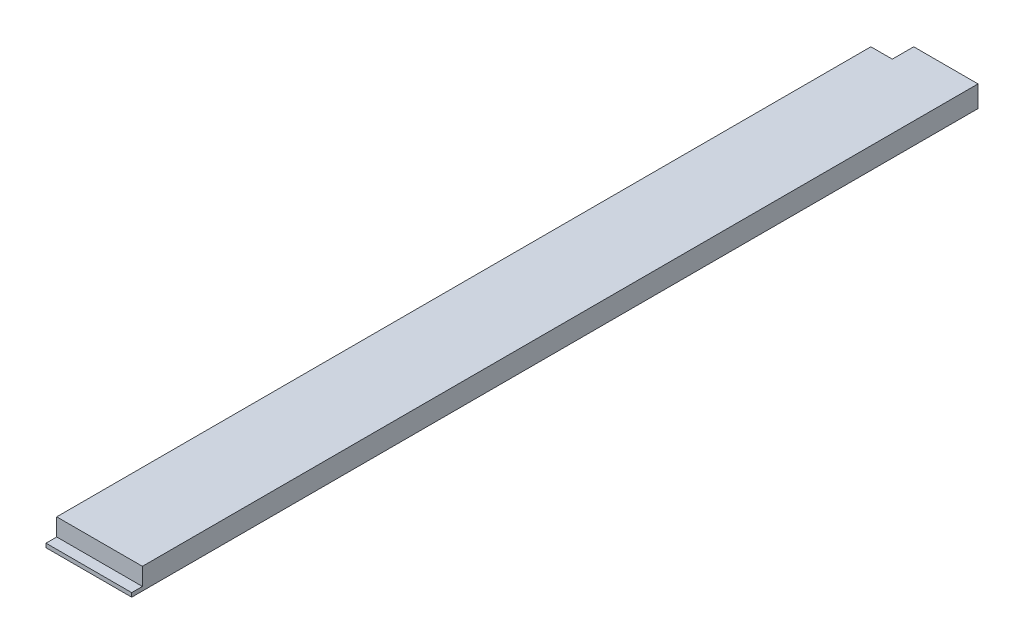
ISO-10303-21;
HEADER;
FILE_DESCRIPTION(('STEP AP214'),'2;1');
FILE_NAME('part.step','',(''),(''),'','','');
FILE_SCHEMA(('AUTOMOTIVE_DESIGN { 1 0 10303 214 1 1 1 1 }'));
ENDSEC;
DATA;
#1=APPLICATION_CONTEXT('core data for automotive mechanical design processes');
#2=APPLICATION_PROTOCOL_DEFINITION('international standard','automotive_design',2000,#1);
#3=PRODUCT_CONTEXT('',#1,'mechanical');
#4=PRODUCT('Part','Part','',(#3));
#5=PRODUCT_RELATED_PRODUCT_CATEGORY('part','',(#4));
#6=PRODUCT_DEFINITION_FORMATION('','',#4);
#7=PRODUCT_DEFINITION_CONTEXT('part definition',#1,'design');
#8=PRODUCT_DEFINITION('design','',#6,#7);
#9=PRODUCT_DEFINITION_SHAPE('','',#8);
#10=(LENGTH_UNIT() NAMED_UNIT(*) SI_UNIT(.MILLI.,.METRE.));
#11=(NAMED_UNIT(*) PLANE_ANGLE_UNIT() SI_UNIT($,.RADIAN.));
#12=(NAMED_UNIT(*) SI_UNIT($,.STERADIAN.) SOLID_ANGLE_UNIT());
#13=UNCERTAINTY_MEASURE_WITH_UNIT(LENGTH_MEASURE(1.E-05),#10,'distance_accuracy_value','');
#14=(GEOMETRIC_REPRESENTATION_CONTEXT(3) GLOBAL_UNCERTAINTY_ASSIGNED_CONTEXT((#13)) GLOBAL_UNIT_ASSIGNED_CONTEXT((#10,
#11,#12)) REPRESENTATION_CONTEXT('',''));
#15=CARTESIAN_POINT('',(0.,0.,0.));
#16=DIRECTION('',(0.,0.,1.));
#17=DIRECTION('',(1.,0.,0.));
#18=AXIS2_PLACEMENT_3D('',#15,#16,#17);
#19=CARTESIAN_POINT('',(50.8,12.7,501.65));
#20=DIRECTION('',(0.,-1.,0.));
#21=DIRECTION('',(1.,0.,0.));
#22=AXIS2_PLACEMENT_3D('',#19,#20,#21);
#23=PLANE('',#22);
#24=DIRECTION('',(-1.,0.,0.));
#25=VECTOR('',#24,1.);
#26=CARTESIAN_POINT('',(50.8,12.7,0.));
#27=LINE('',#26,#25);
#28=CARTESIAN_POINT('',(50.8,12.7,0.));
#29=VERTEX_POINT('',#28);
#30=CARTESIAN_POINT('',(12.7,12.7,0.));
#31=VERTEX_POINT('',#30);
#32=EDGE_CURVE('E136',#29,#31,#27,.T.);
#33=ORIENTED_EDGE('',*,*,#32,.T.);
#34=DIRECTION('',(0.,0.,-1.));
#35=VECTOR('',#34,1.);
#36=CARTESIAN_POINT('',(12.7,12.7,0.));
#37=LINE('',#36,#35);
#38=CARTESIAN_POINT('',(12.7,12.7,12.7));
#39=VERTEX_POINT('',#38);
#40=EDGE_CURVE('E49',#39,#31,#37,.T.);
#41=ORIENTED_EDGE('',*,*,#40,.F.);
#42=DIRECTION('',(1.,0.,0.));
#43=VECTOR('',#42,1.);
#44=CARTESIAN_POINT('',(0.,12.7,12.7));
#45=LINE('',#44,#43);
#46=CARTESIAN_POINT('',(0.,12.7,12.7));
#47=VERTEX_POINT('',#46);
#48=EDGE_CURVE('E162',#47,#39,#45,.T.);
#49=ORIENTED_EDGE('',*,*,#48,.F.);
#50=DIRECTION('',(0.,0.,-1.));
#51=VECTOR('',#50,1.);
#52=CARTESIAN_POINT('',(0.,12.7,501.65));
#53=LINE('',#52,#51);
#54=CARTESIAN_POINT('',(0.,12.7,495.3));
#55=VERTEX_POINT('',#54);
#56=EDGE_CURVE('E11',#55,#47,#53,.T.);
#57=ORIENTED_EDGE('',*,*,#56,.F.);
#58=DIRECTION('',(1.,0.,0.));
#59=VECTOR('',#58,1.);
#60=CARTESIAN_POINT('',(50.8,12.7,495.3));
#61=LINE('',#60,#59);
#62=CARTESIAN_POINT('',(50.8,12.7,495.3));
#63=VERTEX_POINT('',#62);
#64=EDGE_CURVE('E148',#55,#63,#61,.T.);
#65=ORIENTED_EDGE('',*,*,#64,.T.);
#66=DIRECTION('',(0.,0.,-1.));
#67=VECTOR('',#66,1.);
#68=CARTESIAN_POINT('',(50.8,12.7,501.65));
#69=LINE('',#68,#67);
#70=EDGE_CURVE('E125',#63,#29,#69,.T.);
#71=ORIENTED_EDGE('',*,*,#70,.T.);
#72=EDGE_LOOP('',(#33,#41,#49,#57,#65,#71));
#73=FACE_BOUND('',#72,.T.);
#74=ADVANCED_FACE('F35',(#73),#23,.F.);
#75=CARTESIAN_POINT('',(0.,0.,501.65));
#76=DIRECTION('',(1.,0.,0.));
#77=DIRECTION('',(0.,1.,0.));
#78=AXIS2_PLACEMENT_3D('',#75,#76,#77);
#79=PLANE('',#78);
#80=ORIENTED_EDGE('',*,*,#56,.T.);
#81=DIRECTION('',(0.,1.,0.));
#82=VECTOR('',#81,1.);
#83=CARTESIAN_POINT('',(0.,0.,12.7));
#84=LINE('',#83,#82);
#85=CARTESIAN_POINT('',(0.,0.,12.7));
#86=VERTEX_POINT('',#85);
#87=EDGE_CURVE('E103',#86,#47,#84,.T.);
#88=ORIENTED_EDGE('',*,*,#87,.F.);
#89=DIRECTION('',(0.,0.,-1.));
#90=VECTOR('',#89,1.);
#91=CARTESIAN_POINT('',(0.,0.,501.65));
#92=LINE('',#91,#90);
#93=CARTESIAN_POINT('',(0.,0.,501.65));
#94=VERTEX_POINT('',#93);
#95=EDGE_CURVE('E42',#94,#86,#92,.T.);
#96=ORIENTED_EDGE('',*,*,#95,.F.);
#97=DIRECTION('',(0.,-1.,0.));
#98=VECTOR('',#97,1.);
#99=CARTESIAN_POINT('',(0.,12.7,501.65));
#100=LINE('',#99,#98);
#101=CARTESIAN_POINT('',(0.,2.3622,501.65));
#102=VERTEX_POINT('',#101);
#103=EDGE_CURVE('E133',#102,#94,#100,.T.);
#104=ORIENTED_EDGE('',*,*,#103,.F.);
#105=DIRECTION('',(0.,0.,-1.));
#106=VECTOR('',#105,1.);
#107=CARTESIAN_POINT('',(0.,2.3622,495.3));
#108=LINE('',#107,#106);
#109=CARTESIAN_POINT('',(0.,2.3622,495.3));
#110=VERTEX_POINT('',#109);
#111=EDGE_CURVE('E57',#102,#110,#108,.T.);
#112=ORIENTED_EDGE('',*,*,#111,.T.);
#113=DIRECTION('',(0.,1.,0.));
#114=VECTOR('',#113,1.);
#115=CARTESIAN_POINT('',(0.,2.3622,495.3));
#116=LINE('',#115,#114);
#117=EDGE_CURVE('E139',#110,#55,#116,.T.);
#118=ORIENTED_EDGE('',*,*,#117,.T.);
#119=EDGE_LOOP('',(#80,#88,#96,#104,#112,#118));
#120=FACE_BOUND('',#119,.T.);
#121=ADVANCED_FACE('F114',(#120),#79,.F.);
#122=CARTESIAN_POINT('',(50.8,0.,501.65));
#123=DIRECTION('',(-1.,0.,0.));
#124=DIRECTION('',(0.,0.,1.));
#125=AXIS2_PLACEMENT_3D('',#122,#123,#124);
#126=PLANE('',#125);
#127=DIRECTION('',(0.,1.,0.));
#128=VECTOR('',#127,1.);
#129=CARTESIAN_POINT('',(50.8,2.36220000000001,495.3));
#130=LINE('',#129,#128);
#131=CARTESIAN_POINT('',(50.8,2.36220000000001,495.3));
#132=VERTEX_POINT('',#131);
#133=EDGE_CURVE('E145',#132,#63,#130,.T.);
#134=ORIENTED_EDGE('',*,*,#133,.F.);
#135=DIRECTION('',(0.,0.,1.));
#136=VECTOR('',#135,1.);
#137=CARTESIAN_POINT('',(50.8,2.36220000000001,495.3));
#138=LINE('',#137,#136);
#139=CARTESIAN_POINT('',(50.8,2.36220000000001,501.65));
#140=VERTEX_POINT('',#139);
#141=EDGE_CURVE('E151',#132,#140,#138,.T.);
#142=ORIENTED_EDGE('',*,*,#141,.T.);
#143=DIRECTION('',(0.,1.,0.));
#144=VECTOR('',#143,1.);
#145=CARTESIAN_POINT('',(50.8,0.,501.65));
#146=LINE('',#145,#144);
#147=CARTESIAN_POINT('',(50.8,0.,501.65));
#148=VERTEX_POINT('',#147);
#149=EDGE_CURVE('E129',#148,#140,#146,.T.);
#150=ORIENTED_EDGE('',*,*,#149,.F.);
#151=DIRECTION('',(0.,0.,-1.));
#152=VECTOR('',#151,1.);
#153=CARTESIAN_POINT('',(50.8,0.,501.65));
#154=LINE('',#153,#152);
#155=CARTESIAN_POINT('',(50.8,0.,0.));
#156=VERTEX_POINT('',#155);
#157=EDGE_CURVE('E123',#148,#156,#154,.T.);
#158=ORIENTED_EDGE('',*,*,#157,.T.);
#159=DIRECTION('',(0.,1.,0.));
#160=VECTOR('',#159,1.);
#161=CARTESIAN_POINT('',(50.8,0.,0.));
#162=LINE('',#161,#160);
#163=EDGE_CURVE('E130',#156,#29,#162,.T.);
#164=ORIENTED_EDGE('',*,*,#163,.T.);
#165=ORIENTED_EDGE('',*,*,#70,.F.);
#166=EDGE_LOOP('',(#134,#142,#150,#158,#164,#165));
#167=FACE_BOUND('',#166,.T.);
#168=ADVANCED_FACE('F172',(#167),#126,.F.);
#169=CARTESIAN_POINT('',(12.7,0.,501.65));
#170=DIRECTION('',(0.,1.,0.));
#171=DIRECTION('',(0.,0.,1.));
#172=AXIS2_PLACEMENT_3D('',#169,#170,#171);
#173=PLANE('',#172);
#174=DIRECTION('',(1.,0.,0.));
#175=VECTOR('',#174,1.);
#176=CARTESIAN_POINT('',(0.,0.,12.7));
#177=LINE('',#176,#175);
#178=CARTESIAN_POINT('',(12.7,0.,12.7));
#179=VERTEX_POINT('',#178);
#180=EDGE_CURVE('E99',#86,#179,#177,.T.);
#181=ORIENTED_EDGE('',*,*,#180,.T.);
#182=DIRECTION('',(0.,0.,-1.));
#183=VECTOR('',#182,1.);
#184=CARTESIAN_POINT('',(12.7,0.,0.));
#185=LINE('',#184,#183);
#186=CARTESIAN_POINT('',(12.7,0.,0.));
#187=VERTEX_POINT('',#186);
#188=EDGE_CURVE('E110',#179,#187,#185,.T.);
#189=ORIENTED_EDGE('',*,*,#188,.T.);
#190=DIRECTION('',(1.,0.,0.));
#191=VECTOR('',#190,1.);
#192=CARTESIAN_POINT('',(12.7,0.,0.));
#193=LINE('',#192,#191);
#194=EDGE_CURVE('E134',#187,#156,#193,.T.);
#195=ORIENTED_EDGE('',*,*,#194,.T.);
#196=ORIENTED_EDGE('',*,*,#157,.F.);
#197=DIRECTION('',(1.,0.,0.));
#198=VECTOR('',#197,1.);
#199=CARTESIAN_POINT('',(12.7,0.,501.65));
#200=LINE('',#199,#198);
#201=EDGE_CURVE('E122',#94,#148,#200,.T.);
#202=ORIENTED_EDGE('',*,*,#201,.F.);
#203=ORIENTED_EDGE('',*,*,#95,.T.);
#204=EDGE_LOOP('',(#181,#189,#195,#196,#202,#203));
#205=FACE_BOUND('',#204,.T.);
#206=ADVANCED_FACE('F120',(#205),#173,.F.);
#207=CARTESIAN_POINT('',(0.,0.,501.65));
#208=DIRECTION('',(0.,0.,1.));
#209=DIRECTION('',(1.,0.,0.));
#210=AXIS2_PLACEMENT_3D('',#207,#208,#209);
#211=PLANE('',#210);
#212=DIRECTION('',(-1.,0.,0.));
#213=VECTOR('',#212,1.);
#214=CARTESIAN_POINT('',(50.8,2.36220000000001,501.65));
#215=LINE('',#214,#213);
#216=EDGE_CURVE('E155',#140,#102,#215,.T.);
#217=ORIENTED_EDGE('',*,*,#216,.T.);
#218=ORIENTED_EDGE('',*,*,#103,.T.);
#219=ORIENTED_EDGE('',*,*,#201,.T.);
#220=ORIENTED_EDGE('',*,*,#149,.T.);
#221=EDGE_LOOP('',(#217,#218,#219,#220));
#222=FACE_BOUND('',#221,.T.);
#223=ADVANCED_FACE('F176',(#222),#211,.T.);
#224=CARTESIAN_POINT('',(0.,0.,0.));
#225=DIRECTION('',(0.,0.,1.));
#226=DIRECTION('',(1.,0.,0.));
#227=AXIS2_PLACEMENT_3D('',#224,#225,#226);
#228=PLANE('',#227);
#229=ORIENTED_EDGE('',*,*,#194,.F.);
#230=DIRECTION('',(0.,1.,0.));
#231=VECTOR('',#230,1.);
#232=CARTESIAN_POINT('',(12.7,0.,0.));
#233=LINE('',#232,#231);
#234=EDGE_CURVE('E152',#187,#31,#233,.T.);
#235=ORIENTED_EDGE('',*,*,#234,.T.);
#236=ORIENTED_EDGE('',*,*,#32,.F.);
#237=ORIENTED_EDGE('',*,*,#163,.F.);
#238=EDGE_LOOP('',(#229,#235,#236,#237));
#239=FACE_BOUND('',#238,.T.);
#240=ADVANCED_FACE('F167',(#239),#228,.F.);
#241=CARTESIAN_POINT('',(50.8,2.36220000000001,495.3));
#242=DIRECTION('',(0.,0.,1.));
#243=DIRECTION('',(1.,0.,0.));
#244=AXIS2_PLACEMENT_3D('',#241,#242,#243);
#245=PLANE('',#244);
#246=ORIENTED_EDGE('',*,*,#64,.F.);
#247=ORIENTED_EDGE('',*,*,#117,.F.);
#248=DIRECTION('',(1.,0.,0.));
#249=VECTOR('',#248,1.);
#250=CARTESIAN_POINT('',(50.8,2.36220000000001,495.3));
#251=LINE('',#250,#249);
#252=EDGE_CURVE('E147',#110,#132,#251,.T.);
#253=ORIENTED_EDGE('',*,*,#252,.T.);
#254=ORIENTED_EDGE('',*,*,#133,.T.);
#255=EDGE_LOOP('',(#246,#247,#253,#254));
#256=FACE_BOUND('',#255,.T.);
#257=ADVANCED_FACE('F179',(#256),#245,.T.);
#258=CARTESIAN_POINT('',(0.,2.3622,0.));
#259=DIRECTION('',(0.,-1.,0.));
#260=DIRECTION('',(1.,0.,0.));
#261=AXIS2_PLACEMENT_3D('',#258,#259,#260);
#262=PLANE('',#261);
#263=ORIENTED_EDGE('',*,*,#141,.F.);
#264=ORIENTED_EDGE('',*,*,#252,.F.);
#265=ORIENTED_EDGE('',*,*,#111,.F.);
#266=ORIENTED_EDGE('',*,*,#216,.F.);
#267=EDGE_LOOP('',(#263,#264,#265,#266));
#268=FACE_BOUND('',#267,.T.);
#269=ADVANCED_FACE('F180',(#268),#262,.F.);
#270=CARTESIAN_POINT('',(12.7,0.,0.));
#271=DIRECTION('',(1.,0.,0.));
#272=DIRECTION('',(0.,1.,0.));
#273=AXIS2_PLACEMENT_3D('',#270,#271,#272);
#274=PLANE('',#273);
#275=ORIENTED_EDGE('',*,*,#40,.T.);
#276=ORIENTED_EDGE('',*,*,#234,.F.);
#277=ORIENTED_EDGE('',*,*,#188,.F.);
#278=DIRECTION('',(0.,1.,0.));
#279=VECTOR('',#278,1.);
#280=CARTESIAN_POINT('',(12.7,0.,12.7));
#281=LINE('',#280,#279);
#282=EDGE_CURVE('E105',#179,#39,#281,.T.);
#283=ORIENTED_EDGE('',*,*,#282,.T.);
#284=EDGE_LOOP('',(#275,#276,#277,#283));
#285=FACE_BOUND('',#284,.T.);
#286=ADVANCED_FACE('F182',(#285),#274,.F.);
#287=CARTESIAN_POINT('',(0.,0.,12.7));
#288=DIRECTION('',(0.,0.,1.));
#289=DIRECTION('',(1.,0.,0.));
#290=AXIS2_PLACEMENT_3D('',#287,#288,#289);
#291=PLANE('',#290);
#292=ORIENTED_EDGE('',*,*,#48,.T.);
#293=ORIENTED_EDGE('',*,*,#282,.F.);
#294=ORIENTED_EDGE('',*,*,#180,.F.);
#295=ORIENTED_EDGE('',*,*,#87,.T.);
#296=EDGE_LOOP('',(#292,#293,#294,#295));
#297=FACE_BOUND('',#296,.T.);
#298=ADVANCED_FACE('F102',(#297),#291,.F.);
#299=CLOSED_SHELL('',(#74,#121,#168,#206,#223,#240,#257,#269,#286,#298));
#300=MANIFOLD_SOLID_BREP('B2',#299);
#301=ADVANCED_BREP_SHAPE_REPRESENTATION('',(#18,#300),#14);
#302=SHAPE_DEFINITION_REPRESENTATION(#9,#301);
ENDSEC;
END-ISO-10303-21;
